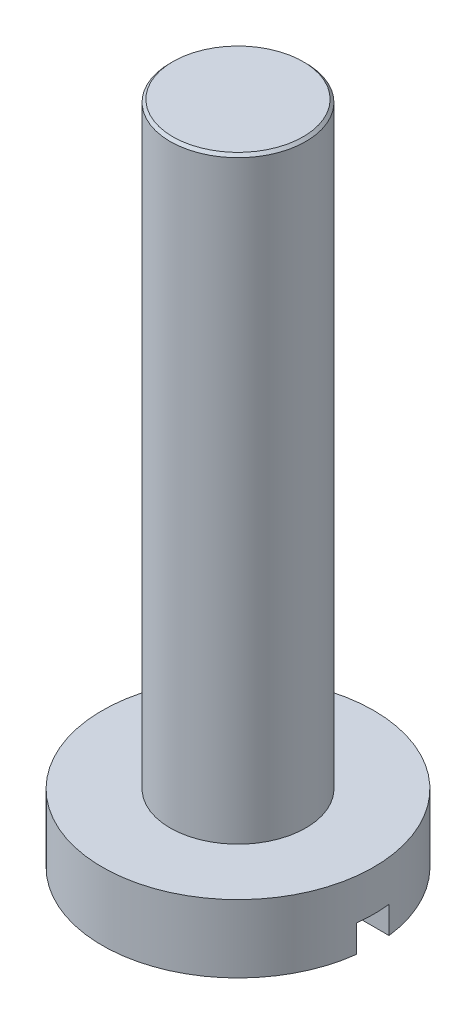
ISO-10303-21;
HEADER;
FILE_DESCRIPTION(('STEP AP214'),'2;1');
FILE_NAME('part.step','',(''),(''),'','','');
FILE_SCHEMA(('AUTOMOTIVE_DESIGN { 1 0 10303 214 1 1 1 1 }'));
ENDSEC;
DATA;
#1=APPLICATION_CONTEXT('core data for automotive mechanical design processes');
#2=APPLICATION_PROTOCOL_DEFINITION('international standard','automotive_design',2000,#1);
#3=PRODUCT_CONTEXT('',#1,'mechanical');
#4=PRODUCT('Part','Part','',(#3));
#5=PRODUCT_RELATED_PRODUCT_CATEGORY('part','',(#4));
#6=PRODUCT_DEFINITION_FORMATION('','',#4);
#7=PRODUCT_DEFINITION_CONTEXT('part definition',#1,'design');
#8=PRODUCT_DEFINITION('design','',#6,#7);
#9=PRODUCT_DEFINITION_SHAPE('','',#8);
#10=(LENGTH_UNIT() NAMED_UNIT(*) SI_UNIT(.MILLI.,.METRE.));
#11=(NAMED_UNIT(*) PLANE_ANGLE_UNIT() SI_UNIT($,.RADIAN.));
#12=(NAMED_UNIT(*) SI_UNIT($,.STERADIAN.) SOLID_ANGLE_UNIT());
#13=UNCERTAINTY_MEASURE_WITH_UNIT(LENGTH_MEASURE(1.E-05),#10,'distance_accuracy_value','');
#14=(GEOMETRIC_REPRESENTATION_CONTEXT(3) GLOBAL_UNCERTAINTY_ASSIGNED_CONTEXT((#13)) GLOBAL_UNIT_ASSIGNED_CONTEXT((#10,
#11,#12)) REPRESENTATION_CONTEXT('',''));
#15=CARTESIAN_POINT('',(0.,0.,0.));
#16=DIRECTION('',(0.,0.,1.));
#17=DIRECTION('',(1.,0.,0.));
#18=AXIS2_PLACEMENT_3D('',#15,#16,#17);
#19=CARTESIAN_POINT('',(0.,-1.25,0.));
#20=DIRECTION('',(0.,-1.,0.));
#21=DIRECTION('',(0.,0.,-1.));
#22=AXIS2_PLACEMENT_3D('',#19,#20,#21);
#23=PLANE('',#22);
#24=DIRECTION('',(1.,0.,0.));
#25=VECTOR('',#24,1.);
#26=CARTESIAN_POINT('',(0.,-1.25,-0.3));
#27=LINE('',#26,#25);
#28=CARTESIAN_POINT('',(-2.48193472919817,-1.25,-0.3));
#29=VERTEX_POINT('',#28);
#30=CARTESIAN_POINT('',(2.48193472919817,-1.25,-0.3));
#31=VERTEX_POINT('',#30);
#32=EDGE_CURVE('E90',#29,#31,#27,.T.);
#33=ORIENTED_EDGE('',*,*,#32,.F.);
#34=CARTESIAN_POINT('',(0.,-1.25,0.));
#35=DIRECTION('',(0.,-1.,0.));
#36=DIRECTION('',(0.,0.,-1.));
#37=AXIS2_PLACEMENT_3D('',#34,#35,#36);
#38=CIRCLE('',#37,2.5);
#39=EDGE_CURVE('E100',#29,#31,#38,.T.);
#40=ORIENTED_EDGE('',*,*,#39,.T.);
#41=EDGE_LOOP('',(#33,#40));
#42=FACE_BOUND('',#41,.T.);
#43=ADVANCED_FACE('F42',(#42),#23,.T.);
#44=CARTESIAN_POINT('',(0.,-1.25,0.));
#45=DIRECTION('',(0.,1.,0.));
#46=DIRECTION('',(0.,0.,1.));
#47=AXIS2_PLACEMENT_3D('',#44,#45,#46);
#48=CYLINDRICAL_SURFACE('',#47,2.5);
#49=CARTESIAN_POINT('',(0.,-0.75,0.));
#50=DIRECTION('',(0.,1.,0.));
#51=DIRECTION('',(0.,0.,1.));
#52=AXIS2_PLACEMENT_3D('',#49,#50,#51);
#53=CIRCLE('',#52,2.5);
#54=CARTESIAN_POINT('',(2.48193472919817,-0.75,0.3));
#55=VERTEX_POINT('',#54);
#56=CARTESIAN_POINT('',(2.48193472919817,-0.75,-0.3));
#57=VERTEX_POINT('',#56);
#58=EDGE_CURVE('E12',#55,#57,#53,.T.);
#59=ORIENTED_EDGE('',*,*,#58,.T.);
#60=DIRECTION('',(0.,1.,0.));
#61=VECTOR('',#60,1.);
#62=CARTESIAN_POINT('',(2.48193472919817,-1.25,-0.3));
#63=LINE('',#62,#61);
#64=EDGE_CURVE('E65',#57,#31,#63,.F.);
#65=ORIENTED_EDGE('',*,*,#64,.T.);
#66=ORIENTED_EDGE('',*,*,#39,.F.);
#67=DIRECTION('',(0.,1.,0.));
#68=VECTOR('',#67,1.);
#69=CARTESIAN_POINT('',(-2.48193472919817,-1.25,-0.3));
#70=LINE('',#69,#68);
#71=CARTESIAN_POINT('',(-2.48193472919817,-0.75,-0.3));
#72=VERTEX_POINT('',#71);
#73=EDGE_CURVE('E106',#29,#72,#70,.T.);
#74=ORIENTED_EDGE('',*,*,#73,.T.);
#75=CARTESIAN_POINT('',(-2.48193472919817,-0.75,0.3));
#76=VERTEX_POINT('',#75);
#77=EDGE_CURVE('E46',#72,#76,#53,.T.);
#78=ORIENTED_EDGE('',*,*,#77,.T.);
#79=DIRECTION('',(0.,1.,0.));
#80=VECTOR('',#79,1.);
#81=CARTESIAN_POINT('',(-2.48193472919817,-1.25,0.3));
#82=LINE('',#81,#80);
#83=CARTESIAN_POINT('',(-2.48193472919817,-1.25,0.3));
#84=VERTEX_POINT('',#83);
#85=EDGE_CURVE('E85',#76,#84,#82,.F.);
#86=ORIENTED_EDGE('',*,*,#85,.T.);
#87=CARTESIAN_POINT('',(2.48193472919817,-1.25,0.3));
#88=VERTEX_POINT('',#87);
#89=EDGE_CURVE('E91',#88,#84,#38,.T.);
#90=ORIENTED_EDGE('',*,*,#89,.F.);
#91=DIRECTION('',(0.,1.,0.));
#92=VECTOR('',#91,1.);
#93=CARTESIAN_POINT('',(2.48193472919817,-1.25,0.3));
#94=LINE('',#93,#92);
#95=EDGE_CURVE('E57',#88,#55,#94,.T.);
#96=ORIENTED_EDGE('',*,*,#95,.T.);
#97=EDGE_LOOP('',(#59,#65,#66,#74,#78,#86,#90,#96));
#98=FACE_BOUND('',#97,.T.);
#99=CARTESIAN_POINT('',(0.,0.,0.));
#100=DIRECTION('',(0.,-1.,0.));
#101=DIRECTION('',(0.,0.,-1.));
#102=AXIS2_PLACEMENT_3D('',#99,#100,#101);
#103=CIRCLE('',#102,2.5);
#104=CARTESIAN_POINT('',(0.,0.,-2.5));
#105=VERTEX_POINT('',#104);
#106=EDGE_CURVE('E103',#105,#105,#103,.T.);
#107=ORIENTED_EDGE('',*,*,#106,.T.);
#108=EDGE_LOOP('',(#107));
#109=FACE_BOUND('',#108,.T.);
#110=ADVANCED_FACE('F44',(#98,#109),#48,.T.);
#111=DIRECTION('',(-1.,0.,0.));
#112=VECTOR('',#111,1.);
#113=CARTESIAN_POINT('',(0.,-1.25,0.3));
#114=LINE('',#113,#112);
#115=EDGE_CURVE('E82',#88,#84,#114,.T.);
#116=ORIENTED_EDGE('',*,*,#115,.F.);
#117=ORIENTED_EDGE('',*,*,#89,.T.);
#118=EDGE_LOOP('',(#116,#117));
#119=FACE_BOUND('',#118,.T.);
#120=ADVANCED_FACE('F99',(#119),#23,.T.);
#121=CARTESIAN_POINT('',(0.,0.,0.));
#122=DIRECTION('',(0.,-1.,0.));
#123=DIRECTION('',(0.,0.,-1.));
#124=AXIS2_PLACEMENT_3D('',#121,#122,#123);
#125=PLANE('',#124);
#126=ORIENTED_EDGE('',*,*,#106,.F.);
#127=EDGE_LOOP('',(#126));
#128=FACE_BOUND('',#127,.T.);
#129=ADVANCED_FACE('F120',(#128),#125,.F.);
#130=CARTESIAN_POINT('',(0.,-0.75,0.));
#131=DIRECTION('',(0.,1.,0.));
#132=DIRECTION('',(0.,0.,1.));
#133=AXIS2_PLACEMENT_3D('',#130,#131,#132);
#134=PLANE('',#133);
#135=DIRECTION('',(-1.,0.,0.));
#136=VECTOR('',#135,1.);
#137=CARTESIAN_POINT('',(-4.09817586391625,-0.75,0.3));
#138=LINE('',#137,#136);
#139=EDGE_CURVE('E171',#55,#76,#138,.T.);
#140=ORIENTED_EDGE('',*,*,#139,.T.);
#141=ORIENTED_EDGE('',*,*,#77,.F.);
#142=DIRECTION('',(1.,0.,0.));
#143=VECTOR('',#142,1.);
#144=CARTESIAN_POINT('',(-4.09817586391625,-0.75,-0.3));
#145=LINE('',#144,#143);
#146=EDGE_CURVE('E97',#72,#57,#145,.T.);
#147=ORIENTED_EDGE('',*,*,#146,.T.);
#148=ORIENTED_EDGE('',*,*,#58,.F.);
#149=EDGE_LOOP('',(#140,#141,#147,#148));
#150=FACE_BOUND('',#149,.T.);
#151=ADVANCED_FACE('F124',(#150),#134,.F.);
#152=CARTESIAN_POINT('',(-4.09817586391625,-0.75,-0.3));
#153=DIRECTION('',(0.,0.,-1.));
#154=DIRECTION('',(-1.,0.,0.));
#155=AXIS2_PLACEMENT_3D('',#152,#153,#154);
#156=PLANE('',#155);
#157=ORIENTED_EDGE('',*,*,#32,.T.);
#158=ORIENTED_EDGE('',*,*,#64,.F.);
#159=ORIENTED_EDGE('',*,*,#146,.F.);
#160=ORIENTED_EDGE('',*,*,#73,.F.);
#161=EDGE_LOOP('',(#157,#158,#159,#160));
#162=FACE_BOUND('',#161,.T.);
#163=ADVANCED_FACE('F110',(#162),#156,.F.);
#164=CARTESIAN_POINT('',(-4.09817586391625,-0.75,0.3));
#165=DIRECTION('',(0.,0.,1.));
#166=DIRECTION('',(1.,0.,0.));
#167=AXIS2_PLACEMENT_3D('',#164,#165,#166);
#168=PLANE('',#167);
#169=ORIENTED_EDGE('',*,*,#115,.T.);
#170=ORIENTED_EDGE('',*,*,#85,.F.);
#171=ORIENTED_EDGE('',*,*,#139,.F.);
#172=ORIENTED_EDGE('',*,*,#95,.F.);
#173=EDGE_LOOP('',(#169,#170,#171,#172));
#174=FACE_BOUND('',#173,.T.);
#175=ADVANCED_FACE('F84',(#174),#168,.F.);
#176=CLOSED_SHELL('',(#43,#110,#120,#129,#151,#163,#175));
#177=MANIFOLD_SOLID_BREP('B2',#176);
#178=CARTESIAN_POINT('',(0.,11.,0.));
#179=DIRECTION('',(0.,-1.,0.));
#180=DIRECTION('',(0.,0.,-1.));
#181=AXIS2_PLACEMENT_3D('',#178,#179,#180);
#182=CYLINDRICAL_SURFACE('',#181,1.25);
#183=CARTESIAN_POINT('',(0.,10.95,0.));
#184=DIRECTION('',(0.,1.,0.));
#185=DIRECTION('',(0.,0.,1.));
#186=AXIS2_PLACEMENT_3D('',#183,#184,#185);
#187=CIRCLE('',#186,1.25);
#188=CARTESIAN_POINT('',(0.,10.95,1.25));
#189=VERTEX_POINT('',#188);
#190=EDGE_CURVE('E41',#189,#189,#187,.F.);
#191=ORIENTED_EDGE('',*,*,#190,.T.);
#192=EDGE_LOOP('',(#191));
#193=FACE_BOUND('',#192,.T.);
#194=CARTESIAN_POINT('',(0.,0.,0.));
#195=DIRECTION('',(0.,1.,0.));
#196=DIRECTION('',(0.,0.,1.));
#197=AXIS2_PLACEMENT_3D('',#194,#195,#196);
#198=CIRCLE('',#197,1.25);
#199=CARTESIAN_POINT('',(0.,0.,1.25));
#200=VERTEX_POINT('',#199);
#201=EDGE_CURVE('E188',#200,#200,#198,.T.);
#202=ORIENTED_EDGE('',*,*,#201,.T.);
#203=EDGE_LOOP('',(#202));
#204=FACE_BOUND('',#203,.T.);
#205=ADVANCED_FACE('F177',(#193,#204),#182,.T.);
#206=CARTESIAN_POINT('',(0.,11.,0.));
#207=DIRECTION('',(0.,1.,0.));
#208=DIRECTION('',(0.,0.,1.));
#209=AXIS2_PLACEMENT_3D('',#206,#207,#208);
#210=PLANE('',#209);
#211=CARTESIAN_POINT('',(0.,11.,0.));
#212=DIRECTION('',(0.,1.,0.));
#213=DIRECTION('',(0.,0.,1.));
#214=AXIS2_PLACEMENT_3D('',#211,#212,#213);
#215=CIRCLE('',#214,1.2);
#216=CARTESIAN_POINT('',(0.,11.,1.2));
#217=VERTEX_POINT('',#216);
#218=EDGE_CURVE('E184',#217,#217,#215,.T.);
#219=ORIENTED_EDGE('',*,*,#218,.T.);
#220=EDGE_LOOP('',(#219));
#221=FACE_BOUND('',#220,.T.);
#222=ADVANCED_FACE('F198',(#221),#210,.T.);
#223=CARTESIAN_POINT('',(0.,0.,0.));
#224=DIRECTION('',(0.,1.,0.));
#225=DIRECTION('',(0.,0.,1.));
#226=AXIS2_PLACEMENT_3D('',#223,#224,#225);
#227=PLANE('',#226);
#228=ORIENTED_EDGE('',*,*,#201,.F.);
#229=EDGE_LOOP('',(#228));
#230=FACE_BOUND('',#229,.T.);
#231=ADVANCED_FACE('F196',(#230),#227,.F.);
#232=CARTESIAN_POINT('',(0.,11.,0.));
#233=DIRECTION('',(0.,-1.,0.));
#234=DIRECTION('',(0.,0.,-1.));
#235=AXIS2_PLACEMENT_3D('',#232,#233,#234);
#236=CONICAL_SURFACE('',#235,1.2,0.785398163397455);
#237=ORIENTED_EDGE('',*,*,#190,.F.);
#238=EDGE_LOOP('',(#237));
#239=FACE_BOUND('',#238,.T.);
#240=ORIENTED_EDGE('',*,*,#218,.F.);
#241=EDGE_LOOP('',(#240));
#242=FACE_BOUND('',#241,.T.);
#243=ADVANCED_FACE('F179',(#239,#242),#236,.T.);
#244=CLOSED_SHELL('',(#205,#222,#231,#243));
#245=MANIFOLD_SOLID_BREP('B6',#244);
#246=ADVANCED_BREP_SHAPE_REPRESENTATION('',(#18,#177,#245),#14);
#247=SHAPE_DEFINITION_REPRESENTATION(#9,#246);
ENDSEC;
END-ISO-10303-21;
